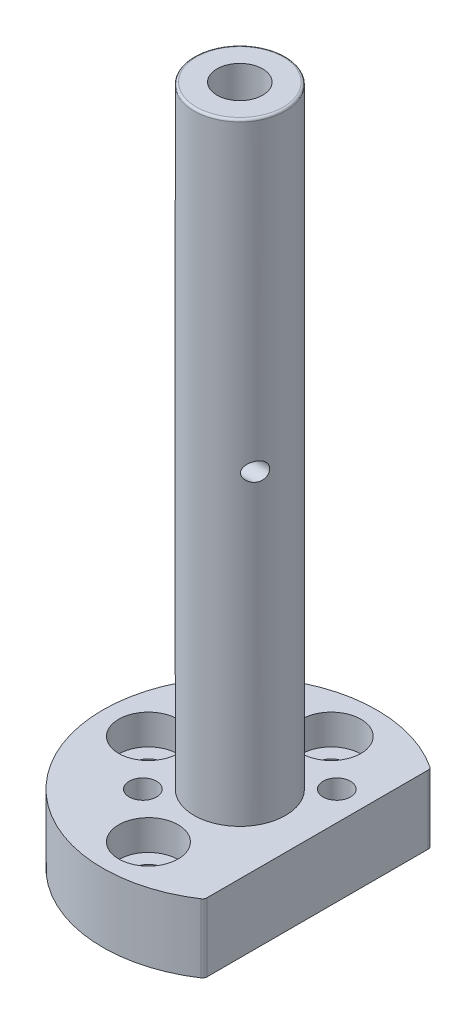
ISO-10303-21;
HEADER;
FILE_DESCRIPTION(('STEP AP214'),'2;1');
FILE_NAME('part.step','',(''),(''),'','','');
FILE_SCHEMA(('AUTOMOTIVE_DESIGN { 1 0 10303 214 1 1 1 1 }'));
ENDSEC;
DATA;
#1=APPLICATION_CONTEXT('core data for automotive mechanical design processes');
#2=APPLICATION_PROTOCOL_DEFINITION('international standard','automotive_design',2000,#1);
#3=PRODUCT_CONTEXT('',#1,'mechanical');
#4=PRODUCT('Part','Part','',(#3));
#5=PRODUCT_RELATED_PRODUCT_CATEGORY('part','',(#4));
#6=PRODUCT_DEFINITION_FORMATION('','',#4);
#7=PRODUCT_DEFINITION_CONTEXT('part definition',#1,'design');
#8=PRODUCT_DEFINITION('design','',#6,#7);
#9=PRODUCT_DEFINITION_SHAPE('','',#8);
#10=(LENGTH_UNIT() NAMED_UNIT(*) SI_UNIT(.MILLI.,.METRE.));
#11=(NAMED_UNIT(*) PLANE_ANGLE_UNIT() SI_UNIT($,.RADIAN.));
#12=(NAMED_UNIT(*) SI_UNIT($,.STERADIAN.) SOLID_ANGLE_UNIT());
#13=UNCERTAINTY_MEASURE_WITH_UNIT(LENGTH_MEASURE(1.E-05),#10,'distance_accuracy_value','');
#14=(GEOMETRIC_REPRESENTATION_CONTEXT(3) GLOBAL_UNCERTAINTY_ASSIGNED_CONTEXT((#13)) GLOBAL_UNIT_ASSIGNED_CONTEXT((#10,
#11,#12)) REPRESENTATION_CONTEXT('',''));
#15=CARTESIAN_POINT('',(0.,0.,0.));
#16=DIRECTION('',(0.,0.,1.));
#17=DIRECTION('',(1.,0.,0.));
#18=AXIS2_PLACEMENT_3D('',#15,#16,#17);
#19=CARTESIAN_POINT('',(0.,15.,0.));
#20=DIRECTION('',(0.,-1.,0.));
#21=DIRECTION('',(0.,0.,-1.));
#22=AXIS2_PLACEMENT_3D('',#19,#20,#21);
#23=CYLINDRICAL_SURFACE('',#22,30.);
#24=CARTESIAN_POINT('',(0.,15.,0.));
#25=DIRECTION('',(0.,1.,0.));
#26=DIRECTION('',(0.,0.,1.));
#27=AXIS2_PLACEMENT_3D('',#24,#25,#26);
#28=CIRCLE('',#27,30.);
#29=CARTESIAN_POINT('',(16.551724137931,15.,-25.0207999085127));
#30=VERTEX_POINT('',#29);
#31=CARTESIAN_POINT('',(16.551724137931,15.,25.0207999085127));
#32=VERTEX_POINT('',#31);
#33=EDGE_CURVE('E107',#30,#32,#28,.T.);
#34=ORIENTED_EDGE('',*,*,#33,.F.);
#35=DIRECTION('',(0.,-1.,0.));
#36=VECTOR('',#35,1.);
#37=CARTESIAN_POINT('',(16.551724137931,15.,-25.0207999085127));
#38=LINE('',#37,#36);
#39=CARTESIAN_POINT('',(16.551724137931,0.,-25.0207999085127));
#40=VERTEX_POINT('',#39);
#41=EDGE_CURVE('E94',#30,#40,#38,.T.);
#42=ORIENTED_EDGE('',*,*,#41,.T.);
#43=CARTESIAN_POINT('',(0.,0.,0.));
#44=DIRECTION('',(0.,1.,0.));
#45=DIRECTION('',(0.,0.,1.));
#46=AXIS2_PLACEMENT_3D('',#43,#44,#45);
#47=CIRCLE('',#46,30.);
#48=CARTESIAN_POINT('',(16.551724137931,0.,25.0207999085127));
#49=VERTEX_POINT('',#48);
#50=EDGE_CURVE('E105',#40,#49,#47,.T.);
#51=ORIENTED_EDGE('',*,*,#50,.T.);
#52=DIRECTION('',(0.,-1.,0.));
#53=VECTOR('',#52,1.);
#54=CARTESIAN_POINT('',(16.551724137931,15.,25.0207999085127));
#55=LINE('',#54,#53);
#56=EDGE_CURVE('E109',#49,#32,#55,.F.);
#57=ORIENTED_EDGE('',*,*,#56,.T.);
#58=EDGE_LOOP('',(#34,#42,#51,#57));
#59=FACE_BOUND('',#58,.T.);
#60=ADVANCED_FACE('F41',(#59),#23,.T.);
#61=CARTESIAN_POINT('',(17.,15.,24.7184141886165));
#62=DIRECTION('',(-1.,0.,0.));
#63=DIRECTION('',(0.,0.,1.));
#64=AXIS2_PLACEMENT_3D('',#61,#62,#63);
#65=PLANE('',#64);
#66=DIRECTION('',(0.,0.,-1.));
#67=VECTOR('',#66,1.);
#68=CARTESIAN_POINT('',(17.,0.,24.7184141886165));
#69=LINE('',#68,#67);
#70=CARTESIAN_POINT('',(17.,0.,24.1867732448956));
#71=VERTEX_POINT('',#70);
#72=CARTESIAN_POINT('',(17.,0.,-24.1867732448956));
#73=VERTEX_POINT('',#72);
#74=EDGE_CURVE('E113',#71,#73,#69,.T.);
#75=ORIENTED_EDGE('',*,*,#74,.T.);
#76=DIRECTION('',(0.,-1.,0.));
#77=VECTOR('',#76,1.);
#78=CARTESIAN_POINT('',(17.,15.,-24.1867732448956));
#79=LINE('',#78,#77);
#80=CARTESIAN_POINT('',(17.,15.,-24.1867732448956));
#81=VERTEX_POINT('',#80);
#82=EDGE_CURVE('E63',#73,#81,#79,.F.);
#83=ORIENTED_EDGE('',*,*,#82,.T.);
#84=DIRECTION('',(0.,0.,-1.));
#85=VECTOR('',#84,1.);
#86=CARTESIAN_POINT('',(17.,15.,24.7184141886165));
#87=LINE('',#86,#85);
#88=CARTESIAN_POINT('',(17.,15.,24.1867732448956));
#89=VERTEX_POINT('',#88);
#90=EDGE_CURVE('E123',#89,#81,#87,.T.);
#91=ORIENTED_EDGE('',*,*,#90,.F.);
#92=DIRECTION('',(0.,-1.,0.));
#93=VECTOR('',#92,1.);
#94=CARTESIAN_POINT('',(17.,15.,24.1867732448956));
#95=LINE('',#94,#93);
#96=EDGE_CURVE('E99',#89,#71,#95,.T.);
#97=ORIENTED_EDGE('',*,*,#96,.T.);
#98=EDGE_LOOP('',(#75,#83,#91,#97));
#99=FACE_BOUND('',#98,.T.);
#100=ADVANCED_FACE('F160',(#99),#65,.F.);
#101=CARTESIAN_POINT('',(0.,15.,0.));
#102=DIRECTION('',(0.,1.,0.));
#103=DIRECTION('',(0.,0.,1.));
#104=AXIS2_PLACEMENT_3D('',#101,#102,#103);
#105=PLANE('',#104);
#106=CARTESIAN_POINT('',(-10.6066017177983,15.,10.6066017177982));
#107=DIRECTION('',(0.,1.,0.));
#108=DIRECTION('',(0.,0.,1.));
#109=AXIS2_PLACEMENT_3D('',#106,#107,#108);
#110=CIRCLE('',#109,3.);
#111=CARTESIAN_POINT('',(-10.6066017177983,15.,13.6066017177982));
#112=VERTEX_POINT('',#111);
#113=EDGE_CURVE('E261',#112,#112,#110,.T.);
#114=ORIENTED_EDGE('',*,*,#113,.F.);
#115=EDGE_LOOP('',(#114));
#116=FACE_BOUND('',#115,.T.);
#117=CARTESIAN_POINT('',(10.6066017177982,15.,-10.6066017177982));
#118=DIRECTION('',(0.,1.,0.));
#119=DIRECTION('',(0.,0.,1.));
#120=AXIS2_PLACEMENT_3D('',#117,#118,#119);
#121=CIRCLE('',#120,3.);
#122=CARTESIAN_POINT('',(10.6066017177982,15.,-7.60660171779821));
#123=VERTEX_POINT('',#122);
#124=EDGE_CURVE('E255',#123,#123,#121,.T.);
#125=ORIENTED_EDGE('',*,*,#124,.F.);
#126=EDGE_LOOP('',(#125));
#127=FACE_BOUND('',#126,.T.);
#128=CARTESIAN_POINT('',(0.,15.,20.));
#129=DIRECTION('',(0.,1.,0.));
#130=DIRECTION('',(0.,0.,1.));
#131=AXIS2_PLACEMENT_3D('',#128,#129,#130);
#132=CIRCLE('',#131,6.5);
#133=CARTESIAN_POINT('',(0.,15.,26.5));
#134=VERTEX_POINT('',#133);
#135=EDGE_CURVE('E301',#134,#134,#132,.T.);
#136=ORIENTED_EDGE('',*,*,#135,.F.);
#137=EDGE_LOOP('',(#136));
#138=FACE_BOUND('',#137,.T.);
#139=CARTESIAN_POINT('',(-20.,15.,0.));
#140=DIRECTION('',(0.,1.,0.));
#141=DIRECTION('',(0.,0.,1.));
#142=AXIS2_PLACEMENT_3D('',#139,#140,#141);
#143=CIRCLE('',#142,6.5);
#144=CARTESIAN_POINT('',(-20.,15.,6.5));
#145=VERTEX_POINT('',#144);
#146=EDGE_CURVE('E309',#145,#145,#143,.T.);
#147=ORIENTED_EDGE('',*,*,#146,.F.);
#148=EDGE_LOOP('',(#147));
#149=FACE_BOUND('',#148,.T.);
#150=CARTESIAN_POINT('',(0.,15.,-20.));
#151=DIRECTION('',(0.,1.,0.));
#152=DIRECTION('',(0.,0.,-1.));
#153=AXIS2_PLACEMENT_3D('',#150,#151,#152);
#154=CIRCLE('',#153,6.5);
#155=CARTESIAN_POINT('',(0.,15.,-26.5));
#156=VERTEX_POINT('',#155);
#157=EDGE_CURVE('E276',#156,#156,#154,.T.);
#158=ORIENTED_EDGE('',*,*,#157,.F.);
#159=EDGE_LOOP('',(#158));
#160=FACE_BOUND('',#159,.T.);
#161=CARTESIAN_POINT('',(0.,15.,0.));
#162=DIRECTION('',(0.,1.,0.));
#163=DIRECTION('',(0.,0.,1.));
#164=AXIS2_PLACEMENT_3D('',#161,#162,#163);
#165=CIRCLE('',#164,10.);
#166=CARTESIAN_POINT('',(0.,15.,10.));
#167=VERTEX_POINT('',#166);
#168=EDGE_CURVE('E127',#167,#167,#165,.T.);
#169=ORIENTED_EDGE('',*,*,#168,.F.);
#170=EDGE_LOOP('',(#169));
#171=FACE_BOUND('',#170,.T.);
#172=ORIENTED_EDGE('',*,*,#90,.T.);
#173=CARTESIAN_POINT('',(16.,15.,-24.1867732448956));
#174=DIRECTION('',(0.,1.,0.));
#175=DIRECTION('',(0.,0.,1.));
#176=AXIS2_PLACEMENT_3D('',#173,#174,#175);
#177=CIRCLE('',#176,1.);
#178=EDGE_CURVE('E138',#81,#30,#177,.T.);
#179=ORIENTED_EDGE('',*,*,#178,.T.);
#180=ORIENTED_EDGE('',*,*,#33,.T.);
#181=CARTESIAN_POINT('',(16.,15.,24.1867732448956));
#182=DIRECTION('',(0.,1.,0.));
#183=DIRECTION('',(0.,0.,1.));
#184=AXIS2_PLACEMENT_3D('',#181,#182,#183);
#185=CIRCLE('',#184,1.);
#186=EDGE_CURVE('E70',#32,#89,#185,.T.);
#187=ORIENTED_EDGE('',*,*,#186,.T.);
#188=EDGE_LOOP('',(#172,#179,#180,#187));
#189=FACE_BOUND('',#188,.T.);
#190=ADVANCED_FACE('F165',(#116,#127,#138,#149,#160,#171,#189),#105,.T.);
#191=CARTESIAN_POINT('',(0.,0.,0.));
#192=DIRECTION('',(0.,1.,0.));
#193=DIRECTION('',(0.,0.,1.));
#194=AXIS2_PLACEMENT_3D('',#191,#192,#193);
#195=PLANE('',#194);
#196=CARTESIAN_POINT('',(-10.6066017177983,0.,10.6066017177982));
#197=DIRECTION('',(0.,1.,0.));
#198=DIRECTION('',(0.,0.,1.));
#199=AXIS2_PLACEMENT_3D('',#196,#197,#198);
#200=CIRCLE('',#199,3.);
#201=CARTESIAN_POINT('',(-10.6066017177983,0.,13.6066017177982));
#202=VERTEX_POINT('',#201);
#203=EDGE_CURVE('E256',#202,#202,#200,.T.);
#204=ORIENTED_EDGE('',*,*,#203,.T.);
#205=EDGE_LOOP('',(#204));
#206=FACE_BOUND('',#205,.T.);
#207=CARTESIAN_POINT('',(10.6066017177982,0.,-10.6066017177982));
#208=DIRECTION('',(0.,1.,0.));
#209=DIRECTION('',(0.,0.,1.));
#210=AXIS2_PLACEMENT_3D('',#207,#208,#209);
#211=CIRCLE('',#210,3.);
#212=CARTESIAN_POINT('',(10.6066017177982,0.,-7.60660171779821));
#213=VERTEX_POINT('',#212);
#214=EDGE_CURVE('E265',#213,#213,#211,.T.);
#215=ORIENTED_EDGE('',*,*,#214,.T.);
#216=EDGE_LOOP('',(#215));
#217=FACE_BOUND('',#216,.T.);
#218=CARTESIAN_POINT('',(0.,0.,20.));
#219=DIRECTION('',(0.,1.,0.));
#220=DIRECTION('',(0.,0.,1.));
#221=AXIS2_PLACEMENT_3D('',#218,#219,#220);
#222=CIRCLE('',#221,3.3);
#223=CARTESIAN_POINT('',(0.,0.,23.3));
#224=VERTEX_POINT('',#223);
#225=EDGE_CURVE('E272',#224,#224,#222,.T.);
#226=ORIENTED_EDGE('',*,*,#225,.T.);
#227=EDGE_LOOP('',(#226));
#228=FACE_BOUND('',#227,.T.);
#229=CARTESIAN_POINT('',(-20.,0.,0.));
#230=DIRECTION('',(0.,1.,0.));
#231=DIRECTION('',(0.,0.,1.));
#232=AXIS2_PLACEMENT_3D('',#229,#230,#231);
#233=CIRCLE('',#232,3.3);
#234=CARTESIAN_POINT('',(-20.,0.,3.3));
#235=VERTEX_POINT('',#234);
#236=EDGE_CURVE('E281',#235,#235,#233,.T.);
#237=ORIENTED_EDGE('',*,*,#236,.T.);
#238=EDGE_LOOP('',(#237));
#239=FACE_BOUND('',#238,.T.);
#240=CARTESIAN_POINT('',(0.,0.,-20.));
#241=DIRECTION('',(0.,1.,0.));
#242=DIRECTION('',(0.,0.,-1.));
#243=AXIS2_PLACEMENT_3D('',#240,#241,#242);
#244=CIRCLE('',#243,3.3);
#245=CARTESIAN_POINT('',(0.,0.,-23.3));
#246=VERTEX_POINT('',#245);
#247=EDGE_CURVE('E289',#246,#246,#244,.T.);
#248=ORIENTED_EDGE('',*,*,#247,.T.);
#249=EDGE_LOOP('',(#248));
#250=FACE_BOUND('',#249,.T.);
#251=CARTESIAN_POINT('',(0.,0.,0.));
#252=DIRECTION('',(0.,-1.,0.));
#253=DIRECTION('',(0.,0.,-1.));
#254=AXIS2_PLACEMENT_3D('',#251,#252,#253);
#255=CIRCLE('',#254,7.25);
#256=CARTESIAN_POINT('',(0.,0.,-7.25));
#257=VERTEX_POINT('',#256);
#258=EDGE_CURVE('E120',#257,#257,#255,.T.);
#259=ORIENTED_EDGE('',*,*,#258,.F.);
#260=EDGE_LOOP('',(#259));
#261=FACE_BOUND('',#260,.T.);
#262=ORIENTED_EDGE('',*,*,#50,.F.);
#263=CARTESIAN_POINT('',(16.,0.,-24.1867732448956));
#264=DIRECTION('',(0.,1.,0.));
#265=DIRECTION('',(0.,0.,1.));
#266=AXIS2_PLACEMENT_3D('',#263,#264,#265);
#267=CIRCLE('',#266,1.);
#268=EDGE_CURVE('E90',#40,#73,#267,.F.);
#269=ORIENTED_EDGE('',*,*,#268,.T.);
#270=ORIENTED_EDGE('',*,*,#74,.F.);
#271=CARTESIAN_POINT('',(16.,0.,24.1867732448956));
#272=DIRECTION('',(0.,1.,0.));
#273=DIRECTION('',(0.,0.,1.));
#274=AXIS2_PLACEMENT_3D('',#271,#272,#273);
#275=CIRCLE('',#274,1.);
#276=EDGE_CURVE('E100',#71,#49,#275,.F.);
#277=ORIENTED_EDGE('',*,*,#276,.T.);
#278=EDGE_LOOP('',(#262,#269,#270,#277));
#279=FACE_BOUND('',#278,.T.);
#280=ADVANCED_FACE('F111',(#206,#217,#228,#239,#250,#261,#279),#195,.F.);
#281=CARTESIAN_POINT('',(0.,149.,0.));
#282=DIRECTION('',(0.,-1.,0.));
#283=DIRECTION('',(0.,0.,-1.));
#284=AXIS2_PLACEMENT_3D('',#281,#282,#283);
#285=CYLINDRICAL_SURFACE('',#284,10.);
#286=CARTESIAN_POINT('',(-9.53939201416946,82.,3.));
#287=CARTESIAN_POINT('',(-9.53939211755733,82.1078432268021,3.00000144407373));
#288=CARTESIAN_POINT('',(-9.53665322959864,82.2157032674124,3.00875128127138));
#289=CARTESIAN_POINT('',(-9.52563893501992,82.428350400446,3.04343984855813));
#290=CARTESIAN_POINT('',(-9.51736203957329,82.5331366586103,3.06938320089882));
#291=CARTESIAN_POINT('',(-9.49512562017939,82.7365925855606,3.13749306643533));
#292=CARTESIAN_POINT('',(-9.48116908824297,82.8352654433753,3.17965103719117));
#293=CARTESIAN_POINT('',(-9.44739494293747,83.0238378502898,3.27863540249102));
#294=CARTESIAN_POINT('',(-9.42757774203097,83.1137380162027,3.3354607647365));
#295=CARTESIAN_POINT('',(-9.38173759418536,83.2832839853038,3.46230774348198));
#296=CARTESIAN_POINT('',(-9.35565726872737,83.362823822435,3.53245003745135));
#297=CARTESIAN_POINT('',(-9.29741042636078,83.5088333930081,3.68302399953707));
#298=CARTESIAN_POINT('',(-9.26524326996758,83.5753017516583,3.7634567484844));
#299=CARTESIAN_POINT('',(-9.19368137773744,83.6963148509398,3.93512182052744));
#300=CARTESIAN_POINT('',(-9.1540555211466,83.7503000747468,4.02665122748365));
#301=CARTESIAN_POINT('',(-9.0689621965015,83.8424049007675,4.2148064876194));
#302=CARTESIAN_POINT('',(-9.02349296578571,83.8805197008767,4.31143387340528));
#303=CARTESIAN_POINT('',(-8.92359915366346,83.9433892177307,4.5147746326115));
#304=CARTESIAN_POINT('',(-8.86875021396026,83.9668433257545,4.62167978724249));
#305=CARTESIAN_POINT('',(-8.75415075230912,83.9961183953185,4.83524156989439));
#306=CARTESIAN_POINT('',(-8.69439832773051,84.0019324787034,4.94189808477365));
#307=CARTESIAN_POINT('',(-8.56379200801821,83.9966513215073,5.16528133712512));
#308=CARTESIAN_POINT('',(-8.49246623834658,83.9834439913296,5.28168128528971));
#309=CARTESIAN_POINT('',(-8.34694478508566,83.9376729002848,5.50878841962288));
#310=CARTESIAN_POINT('',(-8.27274674206313,83.9050928961331,5.61949074380998));
#311=CARTESIAN_POINT('',(-8.1142023095457,83.8166238774676,5.84646565698449));
#312=CARTESIAN_POINT('',(-8.02973740328472,83.7583473268338,5.96172942872328));
#313=CARTESIAN_POINT('',(-7.86290917493328,83.6199079222975,6.18009023484846));
#314=CARTESIAN_POINT('',(-7.78054571530673,83.5397465047606,6.28318806708408));
#315=CARTESIAN_POINT('',(-7.63784801137646,83.3757908954203,6.45548188273154));
#316=CARTESIAN_POINT('',(-7.57636633928086,83.2958094057625,6.52735805210799));
#317=CARTESIAN_POINT('',(-7.4607147550622,83.1219654955586,6.65923333050076));
#318=CARTESIAN_POINT('',(-7.40653245255699,83.0281271789405,6.71925264894009));
#319=CARTESIAN_POINT('',(-7.32117048146995,82.8509466191529,6.81200884570583));
#320=CARTESIAN_POINT('',(-7.28758318662971,82.7703955958487,6.84784015997291));
#321=CARTESIAN_POINT('',(-7.22941531381252,82.6023699530978,6.90922182791959));
#322=CARTESIAN_POINT('',(-7.20482710682637,82.5149012749862,6.93478089174884));
#323=CARTESIAN_POINT('',(-7.16679040078739,82.3340692264959,6.97408716641552));
#324=CARTESIAN_POINT('',(-7.15344300230179,82.2406603181776,6.98772721712533));
#325=CARTESIAN_POINT('',(-7.13990883739731,82.051924183694,7.00155772395048));
#326=CARTESIAN_POINT('',(-7.13971170878817,81.9565985271493,7.00175876977463));
#327=CARTESIAN_POINT('',(-7.15159060586103,81.7806272712357,6.98962024574339));
#328=CARTESIAN_POINT('',(-7.16201038796452,81.6997398587397,6.97897301990207));
#329=CARTESIAN_POINT('',(-7.19168428265346,81.5414338851677,6.94839030936794));
#330=CARTESIAN_POINT('',(-7.21094269418245,81.4640170322428,6.92845030476888));
#331=CARTESIAN_POINT('',(-7.26342595110988,81.2926066245738,6.87346027470903));
#332=CARTESIAN_POINT('',(-7.2990719632592,81.2002236847039,6.83571724822473));
#333=CARTESIAN_POINT('',(-7.37929613481388,81.0250799597254,6.7490356016179));
#334=CARTESIAN_POINT('',(-7.42389164859867,80.9423383711205,6.70007520284169));
#335=CARTESIAN_POINT('',(-7.53449309723022,80.7620217958571,6.57573864722096));
#336=CARTESIAN_POINT('',(-7.60277513899433,80.6682188635214,6.49692898400146));
#337=CARTESIAN_POINT('',(-7.74513498725234,80.4984161211933,6.32655162106975));
#338=CARTESIAN_POINT('',(-7.81921766073449,80.4224314797556,6.23497315636633));
#339=CARTESIAN_POINT('',(-7.97117592311259,80.2871839311294,6.03953193169637));
#340=CARTESIAN_POINT('',(-8.0490961132577,80.2282524861741,5.93547503417447));
#341=CARTESIAN_POINT('',(-8.20470890907491,80.1296941426002,5.71844371896428));
#342=CARTESIAN_POINT('',(-8.28240149952038,80.0900685075087,5.60546871816591));
#343=CARTESIAN_POINT('',(-8.44457280771942,80.0277963102748,5.35849965905416));
#344=CARTESIAN_POINT('',(-8.52873534272202,80.0077839479534,5.22361626022439));
#345=CARTESIAN_POINT('',(-8.69100343674394,79.9959390957662,4.94892503395674));
#346=CARTESIAN_POINT('',(-8.76911000017641,80.0041019226383,4.80911802874116));
#347=CARTESIAN_POINT('',(-8.91107233970391,80.0491485268292,4.54028234820867));
#348=CARTESIAN_POINT('',(-8.97555631505382,80.0838469832999,4.4112267533464));
#349=CARTESIAN_POINT('',(-9.09514533687018,80.1803923207165,4.15905573470748));
#350=CARTESIAN_POINT('',(-9.15026188921165,80.242205557662,4.03593315870205));
#351=CARTESIAN_POINT('',(-9.24289613435602,80.3818671260398,3.81849407697402));
#352=CARTESIAN_POINT('',(-9.2817960427082,80.4562792978824,3.72255451590157));
#353=CARTESIAN_POINT('',(-9.35131879121076,80.6231279461733,3.54429016603627));
#354=CARTESIAN_POINT('',(-9.38194645072669,80.7155538736349,3.46195746086497));
#355=CARTESIAN_POINT('',(-9.43222224437536,80.9054531004781,3.3223709115449));
#356=CARTESIAN_POINT('',(-9.45266597583031,81.0014782333728,3.26342556919702));
#357=CARTESIAN_POINT('',(-9.4870063426905,81.2029911803698,3.16221155915056));
#358=CARTESIAN_POINT('',(-9.50090705751141,81.3084730494481,3.11993250309759));
#359=CARTESIAN_POINT('',(-9.52094536206614,81.5110818660883,3.05818640046483));
#360=CARTESIAN_POINT('',(-9.52787245792646,81.6074400053052,3.03642498155418));
#361=CARTESIAN_POINT('',(-9.53709556983314,81.8025275119141,3.00733163996599));
#362=CARTESIAN_POINT('',(-9.53939191950557,81.9012567079626,2.99999867777886));
#363=CARTESIAN_POINT('',(-9.53939201416946,82.,3.));
#364=B_SPLINE_CURVE_WITH_KNOTS('',3,(#286,#287,#288,#289,#290,#291,#292,#293,#294,#295,#296,
#297,#298,#299,#300,#301,#302,#303,#304,#305,#306,#307,#308,#309,#310,#311,#312,#313,#314,#315,
#316,#317,#318,#319,#320,#321,#322,#323,#324,#325,#326,#327,#328,#329,#330,#331,#332,#333,#334,
#335,#336,#337,#338,#339,#340,#341,#342,#343,#344,#345,#346,#347,#348,#349,#350,#351,#352,#353,
#354,#355,#356,#357,#358,#359,#360,#361,#362,#363),.UNSPECIFIED.,.T.,.F.,(4,2,2,2,2,2,2,2,2,2,2,
2,2,2,2,2,2,2,2,2,2,2,2,2,2,2,2,2,2,2,2,2,2,2,2,2,2,2,4),(0.,0.323173196200586,
0.646433308549124,0.969523348691965,1.29259065578976,1.61873887729069,1.94492138308186,
2.28369893168693,2.62257891391914,2.98835773871399,3.35427916877873,3.76409613575129,
4.17425720487948,4.63522894510468,5.09617043772094,5.46648906419166,5.83617094903617,
6.11815142133564,6.39989228690106,6.68414087820215,6.96816548377287,7.21377795910425,
7.45951002254533,7.77569108966934,8.0924913074135,8.51104889941355,8.92996152269598,
9.35654041882128,9.78314722994196,10.2613666098942,10.7395065043525,11.1820201164254,
11.6239862042202,12.004346333141,12.3844843860509,12.7262999512446,13.0679021193264,
13.3638269126943,13.6597303851456),.UNSPECIFIED.);
#365=CARTESIAN_POINT('',(-9.53939201416946,82.,3.));
#366=VERTEX_POINT('',#365);
#367=EDGE_CURVE('E248',#366,#366,#364,.T.);
#368=ORIENTED_EDGE('',*,*,#367,.T.);
#369=EDGE_LOOP('',(#368));
#370=FACE_BOUND('',#369,.T.);
#371=CARTESIAN_POINT('',(9.53939201416946,82.,3.));
#372=CARTESIAN_POINT('',(9.53939211755733,81.8921567731979,3.00000144407373));
#373=CARTESIAN_POINT('',(9.53665322959864,81.7842967325876,3.00875128127138));
#374=CARTESIAN_POINT('',(9.52563893501992,81.571649599554,3.04343984855813));
#375=CARTESIAN_POINT('',(9.51736203957329,81.4668633413897,3.06938320089882));
#376=CARTESIAN_POINT('',(9.49512562017939,81.2634074144394,3.13749306643532));
#377=CARTESIAN_POINT('',(9.48116908824297,81.1647345566247,3.17965103719117));
#378=CARTESIAN_POINT('',(9.44739494293747,80.9761621497102,3.27863540249102));
#379=CARTESIAN_POINT('',(9.42757774203097,80.8862619837973,3.33546076473651));
#380=CARTESIAN_POINT('',(9.38173759418537,80.7167160146962,3.46230774348197));
#381=CARTESIAN_POINT('',(9.35565726872737,80.6371761775651,3.53245003745134));
#382=CARTESIAN_POINT('',(9.29741042636078,80.4911666069919,3.68302399953706));
#383=CARTESIAN_POINT('',(9.26524326996759,80.4246982483418,3.76345674848439));
#384=CARTESIAN_POINT('',(9.19368137773744,80.3036851490602,3.93512182052744));
#385=CARTESIAN_POINT('',(9.1540555211466,80.2496999252532,4.02665122748365));
#386=CARTESIAN_POINT('',(9.0689621965015,80.1575950992326,4.2148064876194));
#387=CARTESIAN_POINT('',(9.02349296578571,80.1194802991233,4.31143387340528));
#388=CARTESIAN_POINT('',(8.92359915366346,80.0566107822693,4.5147746326115));
#389=CARTESIAN_POINT('',(8.86875021396026,80.0331566742455,4.62167978724249));
#390=CARTESIAN_POINT('',(8.75415075230912,80.0038816046815,4.83524156989439));
#391=CARTESIAN_POINT('',(8.69439832773051,79.9980675212966,4.94189808477365));
#392=CARTESIAN_POINT('',(8.56379200801821,80.0033486784927,5.16528133712512));
#393=CARTESIAN_POINT('',(8.49246623834658,80.0165560086704,5.28168128528971));
#394=CARTESIAN_POINT('',(8.34694478508566,80.0623270997152,5.50878841962288));
#395=CARTESIAN_POINT('',(8.27274674206313,80.0949071038669,5.61949074380998));
#396=CARTESIAN_POINT('',(8.1142023095457,80.1833761225324,5.84646565698449));
#397=CARTESIAN_POINT('',(8.02973740328471,80.2416526731662,5.96172942872328));
#398=CARTESIAN_POINT('',(7.86290917493328,80.3800920777025,6.18009023484847));
#399=CARTESIAN_POINT('',(7.78054571530672,80.4602534952394,6.28318806708408));
#400=CARTESIAN_POINT('',(7.63784801137646,80.6242091045797,6.45548188273154));
#401=CARTESIAN_POINT('',(7.57636633928086,80.7041905942375,6.52735805210799));
#402=CARTESIAN_POINT('',(7.4607147550622,80.8780345044414,6.65923333050076));
#403=CARTESIAN_POINT('',(7.40653245255699,80.9718728210595,6.71925264894009));
#404=CARTESIAN_POINT('',(7.32117048146995,81.1490533808471,6.81200884570583));
#405=CARTESIAN_POINT('',(7.28758318662971,81.2296044041513,6.84784015997291));
#406=CARTESIAN_POINT('',(7.22941531381253,81.3976300469022,6.90922182791959));
#407=CARTESIAN_POINT('',(7.20482710682637,81.4850987250138,6.93478089174884));
#408=CARTESIAN_POINT('',(7.16679040078739,81.6659307735041,6.97408716641552));
#409=CARTESIAN_POINT('',(7.15344300230179,81.7593396818224,6.98772721712533));
#410=CARTESIAN_POINT('',(7.13990883739731,81.948075816306,7.00155772395048));
#411=CARTESIAN_POINT('',(7.13971170878817,82.0434014728507,7.00175876977463));
#412=CARTESIAN_POINT('',(7.15159060586103,82.2193727287643,6.98962024574339));
#413=CARTESIAN_POINT('',(7.16201038796452,82.3002601412603,6.97897301990207));
#414=CARTESIAN_POINT('',(7.19168428265346,82.4585661148323,6.94839030936794));
#415=CARTESIAN_POINT('',(7.21094269418245,82.5359829677572,6.92845030476888));
#416=CARTESIAN_POINT('',(7.26342595110988,82.7073933754262,6.87346027470903));
#417=CARTESIAN_POINT('',(7.2990719632592,82.7997763152961,6.83571724822473));
#418=CARTESIAN_POINT('',(7.37929613481388,82.9749200402745,6.7490356016179));
#419=CARTESIAN_POINT('',(7.42389164859867,83.0576616288795,6.70007520284169));
#420=CARTESIAN_POINT('',(7.53449309723022,83.2379782041429,6.57573864722096));
#421=CARTESIAN_POINT('',(7.60277513899433,83.3317811364786,6.49692898400146));
#422=CARTESIAN_POINT('',(7.74513498725234,83.5015838788068,6.32655162106975));
#423=CARTESIAN_POINT('',(7.81921766073449,83.5775685202444,6.23497315636633));
#424=CARTESIAN_POINT('',(7.97117592311259,83.7128160688706,6.03953193169637));
#425=CARTESIAN_POINT('',(8.0490961132577,83.7717475138259,5.93547503417447));
#426=CARTESIAN_POINT('',(8.20470890907491,83.8703058573998,5.71844371896428));
#427=CARTESIAN_POINT('',(8.28240149952038,83.9099314924913,5.60546871816591));
#428=CARTESIAN_POINT('',(8.44457280771942,83.9722036897252,5.35849965905416));
#429=CARTESIAN_POINT('',(8.52873534272202,83.9922160520467,5.22361626022439));
#430=CARTESIAN_POINT('',(8.69100343674394,84.0040609042339,4.94892503395674));
#431=CARTESIAN_POINT('',(8.76911000017641,83.9958980773617,4.80911802874116));
#432=CARTESIAN_POINT('',(8.91107233970391,83.9508514731708,4.54028234820867));
#433=CARTESIAN_POINT('',(8.97555631505382,83.9161530167001,4.4112267533464));
#434=CARTESIAN_POINT('',(9.09514533687018,83.8196076792835,4.15905573470748));
#435=CARTESIAN_POINT('',(9.15026188921165,83.757794442338,4.03593315870205));
#436=CARTESIAN_POINT('',(9.24289613435602,83.6181328739602,3.81849407697402));
#437=CARTESIAN_POINT('',(9.2817960427082,83.5437207021176,3.72255451590157));
#438=CARTESIAN_POINT('',(9.35131879121076,83.3768720538267,3.54429016603627));
#439=CARTESIAN_POINT('',(9.38194645072669,83.2844461263652,3.46195746086497));
#440=CARTESIAN_POINT('',(9.43222224437536,83.0945468995219,3.3223709115449));
#441=CARTESIAN_POINT('',(9.45266597583031,82.9985217666272,3.26342556919702));
#442=CARTESIAN_POINT('',(9.4870063426905,82.7970088196302,3.16221155915056));
#443=CARTESIAN_POINT('',(9.50090705751141,82.6915269505519,3.11993250309759));
#444=CARTESIAN_POINT('',(9.52094536206614,82.4889181339118,3.05818640046483));
#445=CARTESIAN_POINT('',(9.52787245792646,82.3925599946948,3.03642498155418));
#446=CARTESIAN_POINT('',(9.53709556983314,82.1974724880859,3.00733163996599));
#447=CARTESIAN_POINT('',(9.53939191950557,82.0987432920374,2.99999867777886));
#448=CARTESIAN_POINT('',(9.53939201416946,82.,3.));
#449=B_SPLINE_CURVE_WITH_KNOTS('',3,(#371,#372,#373,#374,#375,#376,#377,#378,#379,#380,#381,
#382,#383,#384,#385,#386,#387,#388,#389,#390,#391,#392,#393,#394,#395,#396,#397,#398,#399,#400,
#401,#402,#403,#404,#405,#406,#407,#408,#409,#410,#411,#412,#413,#414,#415,#416,#417,#418,#419,
#420,#421,#422,#423,#424,#425,#426,#427,#428,#429,#430,#431,#432,#433,#434,#435,#436,#437,#438,
#439,#440,#441,#442,#443,#444,#445,#446,#447,#448),.UNSPECIFIED.,.T.,.F.,(4,2,2,2,2,2,2,2,2,2,2,
2,2,2,2,2,2,2,2,2,2,2,2,2,2,2,2,2,2,2,2,2,2,2,2,2,2,2,4),(0.,0.323173196200586,
0.646433308549124,0.969523348691965,1.29259065578976,1.61873887729067,1.94492138308186,
2.28369893168693,2.62257891391914,2.98835773871399,3.35427916877873,3.76409613575129,
4.17425720487948,4.63522894510468,5.09617043772094,5.46648906419166,5.83617094903617,
6.11815142133563,6.39989228690106,6.68414087820216,6.96816548377287,7.21377795910426,
7.45951002254533,7.77569108966932,8.0924913074135,8.51104889941355,8.92996152269598,
9.35654041882128,9.78314722994196,10.2613666098942,10.7395065043525,11.1820201164254,
11.6239862042203,12.004346333141,12.3844843860509,12.7262999512446,13.0679021193264,
13.3638269126943,13.6597303851456),.UNSPECIFIED.);
#450=CARTESIAN_POINT('',(9.53939201416946,82.,3.));
#451=VERTEX_POINT('',#450);
#452=EDGE_CURVE('E243',#451,#451,#449,.T.);
#453=ORIENTED_EDGE('',*,*,#452,.T.);
#454=EDGE_LOOP('',(#453));
#455=FACE_BOUND('',#454,.T.);
#456=CARTESIAN_POINT('',(0.,148.5,0.));
#457=DIRECTION('',(0.,1.,0.));
#458=DIRECTION('',(0.,0.,1.));
#459=AXIS2_PLACEMENT_3D('',#456,#457,#458);
#460=CIRCLE('',#459,10.);
#461=CARTESIAN_POINT('',(0.,148.5,10.));
#462=VERTEX_POINT('',#461);
#463=EDGE_CURVE('E11',#462,#462,#460,.F.);
#464=ORIENTED_EDGE('',*,*,#463,.T.);
#465=EDGE_LOOP('',(#464));
#466=FACE_BOUND('',#465,.T.);
#467=ORIENTED_EDGE('',*,*,#168,.T.);
#468=EDGE_LOOP('',(#467));
#469=FACE_BOUND('',#468,.T.);
#470=ADVANCED_FACE('F236',(#370,#455,#466,#469),#285,.T.);
#471=CARTESIAN_POINT('',(0.,149.,0.));
#472=DIRECTION('',(0.,1.,0.));
#473=DIRECTION('',(0.,0.,1.));
#474=AXIS2_PLACEMENT_3D('',#471,#472,#473);
#475=PLANE('',#474);
#476=CARTESIAN_POINT('',(0.,149.,0.));
#477=DIRECTION('',(0.,1.,0.));
#478=DIRECTION('',(0.,0.,1.));
#479=AXIS2_PLACEMENT_3D('',#476,#477,#478);
#480=CIRCLE('',#479,9.5);
#481=CARTESIAN_POINT('',(0.,149.,9.5));
#482=VERTEX_POINT('',#481);
#483=EDGE_CURVE('E56',#482,#482,#480,.T.);
#484=ORIENTED_EDGE('',*,*,#483,.T.);
#485=EDGE_LOOP('',(#484));
#486=FACE_BOUND('',#485,.T.);
#487=CARTESIAN_POINT('',(0.,149.,0.));
#488=DIRECTION('',(0.,-1.,0.));
#489=DIRECTION('',(0.,0.,-1.));
#490=AXIS2_PLACEMENT_3D('',#487,#488,#489);
#491=CIRCLE('',#490,5.);
#492=CARTESIAN_POINT('',(0.,149.,-5.));
#493=VERTEX_POINT('',#492);
#494=EDGE_CURVE('E320',#493,#493,#491,.T.);
#495=ORIENTED_EDGE('',*,*,#494,.T.);
#496=EDGE_LOOP('',(#495));
#497=FACE_BOUND('',#496,.T.);
#498=ADVANCED_FACE('F145',(#486,#497),#475,.T.);
#499=CARTESIAN_POINT('',(0.,57.,0.));
#500=DIRECTION('',(0.,-1.,0.));
#501=DIRECTION('',(0.,0.,-1.));
#502=AXIS2_PLACEMENT_3D('',#499,#500,#501);
#503=CYLINDRICAL_SURFACE('',#502,7.25);
#504=CARTESIAN_POINT('',(0.,57.,0.));
#505=DIRECTION('',(0.,-1.,0.));
#506=DIRECTION('',(0.,0.,-1.));
#507=AXIS2_PLACEMENT_3D('',#504,#505,#506);
#508=CIRCLE('',#507,7.25);
#509=CARTESIAN_POINT('',(0.,57.,-7.25));
#510=VERTEX_POINT('',#509);
#511=EDGE_CURVE('E114',#510,#510,#508,.T.);
#512=ORIENTED_EDGE('',*,*,#511,.F.);
#513=EDGE_LOOP('',(#512));
#514=FACE_BOUND('',#513,.T.);
#515=ORIENTED_EDGE('',*,*,#258,.T.);
#516=EDGE_LOOP('',(#515));
#517=FACE_BOUND('',#516,.T.);
#518=ADVANCED_FACE('F229',(#514,#517),#503,.F.);
#519=CARTESIAN_POINT('',(0.,57.,0.));
#520=DIRECTION('',(0.,-1.,0.));
#521=DIRECTION('',(0.,0.,-1.));
#522=AXIS2_PLACEMENT_3D('',#519,#520,#521);
#523=PLANE('',#522);
#524=CARTESIAN_POINT('',(0.,57.,0.));
#525=DIRECTION('',(0.,-1.,0.));
#526=DIRECTION('',(0.,0.,-1.));
#527=AXIS2_PLACEMENT_3D('',#524,#525,#526);
#528=CIRCLE('',#527,5.);
#529=CARTESIAN_POINT('',(0.,57.,-5.));
#530=VERTEX_POINT('',#529);
#531=EDGE_CURVE('E300',#530,#530,#528,.T.);
#532=ORIENTED_EDGE('',*,*,#531,.F.);
#533=EDGE_LOOP('',(#532));
#534=FACE_BOUND('',#533,.T.);
#535=ORIENTED_EDGE('',*,*,#511,.T.);
#536=EDGE_LOOP('',(#535));
#537=FACE_BOUND('',#536,.T.);
#538=ADVANCED_FACE('F225',(#534,#537),#523,.T.);
#539=CARTESIAN_POINT('',(0.,149.,0.));
#540=DIRECTION('',(0.,-1.,0.));
#541=DIRECTION('',(0.,0.,-1.));
#542=AXIS2_PLACEMENT_3D('',#539,#540,#541);
#543=CYLINDRICAL_SURFACE('',#542,5.);
#544=CARTESIAN_POINT('',(-4.,82.,3.));
#545=CARTESIAN_POINT('',(-4.00000000072551,81.9072627867282,3.00000135596089));
#546=CARTESIAN_POINT('',(-3.99516043631315,81.8145107061337,3.00648582296121));
#547=CARTESIAN_POINT('',(-3.97581205691488,81.6317805560535,3.03202372065634));
#548=CARTESIAN_POINT('',(-3.96130070246548,81.5418032216095,3.05108045236138));
#549=CARTESIAN_POINT('',(-3.92271386202954,81.3673714343172,3.10053026227591));
#550=CARTESIAN_POINT('',(-3.89865512693191,81.282907608656,3.13090348002475));
#551=CARTESIAN_POINT('',(-3.84120112748192,81.1214707560312,3.20112819977807));
#552=CARTESIAN_POINT('',(-3.8078060543256,81.0444975757123,3.24097950768111));
#553=CARTESIAN_POINT('',(-3.73112610908567,80.8976156512231,3.32899029878796));
#554=CARTESIAN_POINT('',(-3.68760351410154,80.8279469283825,3.37734127223399));
#555=CARTESIAN_POINT('',(-3.59196170830919,80.6988509541478,3.47889167230732));
#556=CARTESIAN_POINT('',(-3.53983909298436,80.639427777818,3.53209301531838));
#557=CARTESIAN_POINT('',(-3.40564766196733,80.5092183983463,3.66242802128094));
#558=CARTESIAN_POINT('',(-3.3199128815945,80.4433107137262,3.74066551996185));
#559=CARTESIAN_POINT('',(-3.13624032140272,80.3295430830544,3.89596240144658));
#560=CARTESIAN_POINT('',(-3.0382791695163,80.2817184299238,3.9730192016394));
#561=CARTESIAN_POINT('',(-2.8621400524623,80.2125212866493,4.10078517314178));
#562=CARTESIAN_POINT('',(-2.7862505079437,80.1874938416317,4.1527592122713));
#563=CARTESIAN_POINT('',(-2.63037811549292,80.143850961781,4.25319905255132));
#564=CARTESIAN_POINT('',(-2.55039350371314,80.1252383171073,4.30166331988275));
#565=CARTESIAN_POINT('',(-2.38690849532258,80.0932304038284,4.39448807131395));
#566=CARTESIAN_POINT('',(-2.30340226442209,80.0798442029146,4.43884132220249));
#567=CARTESIAN_POINT('',(-2.13354390969296,80.0572423700509,4.52293911759511));
#568=CARTESIAN_POINT('',(-2.04719099672198,80.0480279051772,4.56268237010558));
#569=CARTESIAN_POINT('',(-1.83675152936763,80.0297231065387,4.65233047096251));
#570=CARTESIAN_POINT('',(-1.71151123646455,80.0221860370489,4.6998562842239));
#571=CARTESIAN_POINT('',(-1.45744522286908,80.0111570495736,4.78474781771475));
#572=CARTESIAN_POINT('',(-1.32861821251788,80.0076666063628,4.82210982999796));
#573=CARTESIAN_POINT('',(-1.06833708452818,80.0029704450699,4.88637127187215));
#574=CARTESIAN_POINT('',(-0.936882831084827,80.0017648454038,4.91327015913535));
#575=CARTESIAN_POINT('',(-0.672253327672415,80.0003584699958,4.95641478124793));
#576=CARTESIAN_POINT('',(-0.539078297687345,80.0001575670631,4.97266186434884));
#577=CARTESIAN_POINT('',(-0.270041827576877,79.9999768052536,4.99455078012599));
#578=CARTESIAN_POINT('',(-0.13416843316988,79.9999999772572,5.00004598487397));
#579=CARTESIAN_POINT('',(0.137584123841791,80.0000000226951,4.99995343178379));
#580=CARTESIAN_POINT('',(0.273463286162183,79.9999768928118,4.99436487979286));
#581=CARTESIAN_POINT('',(0.544367890982376,80.0001633783043,4.97213662119716));
#582=CARTESIAN_POINT('',(0.679392973344196,80.0003730860341,4.95549253051488));
#583=CARTESIAN_POINT('',(0.947622401519009,80.0018468648125,4.91126078407638));
#584=CARTESIAN_POINT('',(1.08082698429485,80.0031107972848,4.88367456689497));
#585=CARTESIAN_POINT('',(1.32693635001305,80.007718751412,4.8221485677428));
#586=CARTESIAN_POINT('',(1.44018187860206,80.0107633056579,4.78954437751956));
#587=CARTESIAN_POINT('',(1.66400158752259,80.0198583464008,4.71645609631557));
#588=CARTESIAN_POINT('',(1.77457553150515,80.0259090978354,4.67597131100521));
#589=CARTESIAN_POINT('',(1.99213736579564,80.0424852028134,4.58749855900429));
#590=CARTESIAN_POINT('',(2.09913119006473,80.0530027114888,4.53952383969672));
#591=CARTESIAN_POINT('',(2.3087984389113,80.080266849586,4.43656419295055));
#592=CARTESIAN_POINT('',(2.41147411582111,80.0970101856326,4.38158298193692));
#593=CARTESIAN_POINT('',(2.63829046035143,80.1443777350855,4.24980078019194));
#594=CARTESIAN_POINT('',(2.76085736769533,80.1775123393305,4.17109014027889));
#595=CARTESIAN_POINT('',(2.93605641625106,80.240614312191,4.04780282070473));
#596=CARTESIAN_POINT('',(2.99299990985859,80.2638735060334,4.00584893364658));
#597=CARTESIAN_POINT('',(3.10361920768457,80.3154427536055,3.92076669584935));
#598=CARTESIAN_POINT('',(3.1572957633135,80.3437516399501,3.87763861850748));
#599=CARTESIAN_POINT('',(3.29084762326755,80.4239421873757,3.76585093886714));
#600=CARTESIAN_POINT('',(3.36798153164824,80.4800036459336,3.69680982115078));
#601=CARTESIAN_POINT('',(3.51093397547679,80.6075788794191,3.56132502493249));
#602=CARTESIAN_POINT('',(3.57676505918938,80.6790753168476,3.49487853008559));
#603=CARTESIAN_POINT('',(3.68624348190429,80.825529332557,3.37890293968261));
#604=CARTESIAN_POINT('',(3.73174451740288,80.8982758660034,3.32834198880958));
#605=CARTESIAN_POINT('',(3.81251694242839,81.0540744766498,3.23550741937649));
#606=CARTESIAN_POINT('',(3.84779044412804,81.1371244209412,3.19323209026929));
#607=CARTESIAN_POINT('',(3.9076834921585,81.3119901222976,3.11966139901709));
#608=CARTESIAN_POINT('',(3.93225996232724,81.4038395367361,3.08841052547609));
#609=CARTESIAN_POINT('',(3.9703040744955,81.5932736086182,3.03935265852824));
#610=CARTESIAN_POINT('',(3.98377338177769,81.6908574039625,3.02154364983377));
#611=CARTESIAN_POINT('',(3.99894303782078,81.8809658729049,3.00143238408808));
#612=CARTESIAN_POINT('',(4.00145710245281,81.9733143276011,2.9980583315518));
#613=CARTESIAN_POINT('',(3.99694158784794,82.1573430311502,3.00407615575024));
#614=CARTESIAN_POINT('',(3.98991450328855,82.2490234483711,3.01346469551329));
#615=CARTESIAN_POINT('',(3.96659642271157,82.4270729395803,3.04408715636781));
#616=CARTESIAN_POINT('',(3.95050916466955,82.513514014711,3.06506037730042));
#617=CARTESIAN_POINT('',(3.9093153752988,82.6808905877009,3.11742765208054));
#618=CARTESIAN_POINT('',(3.88420906955577,82.7618262232027,3.14882144528571));
#619=CARTESIAN_POINT('',(3.82441011133243,82.9184331109438,3.22120141791421));
#620=CARTESIAN_POINT('',(3.78947518393681,82.9939011738248,3.26242538066545));
#621=CARTESIAN_POINT('',(3.71083270073151,83.1357000664391,3.35160377382312));
#622=CARTESIAN_POINT('',(3.66712288372799,83.202028533553,3.399559938085));
#623=CARTESIAN_POINT('',(3.56737554863946,83.3304453185987,3.50421213691674));
#624=CARTESIAN_POINT('',(3.51058349473178,83.3916180463047,3.56130629101543));
#625=CARTESIAN_POINT('',(3.38860964573127,83.5025348766301,3.67755646583359));
#626=CARTESIAN_POINT('',(3.32342366414862,83.5522732416227,3.73671350461237));
#627=CARTESIAN_POINT('',(3.2014402649282,83.631174682737,3.84131758539795));
#628=CARTESIAN_POINT('',(3.1460551795014,83.6624492183802,3.88685472493154));
#629=CARTESIAN_POINT('',(3.03153970772118,83.7192808646941,3.97681626305743));
#630=CARTESIAN_POINT('',(2.97240765552207,83.744835409132,4.02124015429354));
#631=CARTESIAN_POINT('',(2.85080532456752,83.7909186218147,4.10834720440919));
#632=CARTESIAN_POINT('',(2.7883283433084,83.8114367010759,4.15102654113877));
#633=CARTESIAN_POINT('',(2.66058051966965,83.8480714360157,4.23404305943955));
#634=CARTESIAN_POINT('',(2.59530878944626,83.8641866808078,4.27437948697361));
#635=CARTESIAN_POINT('',(2.4306389325248,83.8994792513193,4.37091934755999));
#636=CARTESIAN_POINT('',(2.32981755646779,83.9164488286886,4.4255105576792));
#637=CARTESIAN_POINT('',(2.12396131518425,83.9442097694309,4.52791637179059));
#638=CARTESIAN_POINT('',(2.01892440329553,83.95499809198,4.57572763174724));
#639=CARTESIAN_POINT('',(1.80539883531357,83.9721063462433,4.66410742063461));
#640=CARTESIAN_POINT('',(1.69690719237158,83.9784222952986,4.70466947016102));
#641=CARTESIAN_POINT('',(1.47727415206521,83.9880071941827,4.77818731415833));
#642=CARTESIAN_POINT('',(1.36613308944817,83.991276526873,4.81114406397824));
#643=CARTESIAN_POINT('',(1.13697990069435,83.9960356428437,4.87051127285106));
#644=CARTESIAN_POINT('',(1.01887760941582,83.997443021466,4.89658003697863));
#645=CARTESIAN_POINT('',(0.781087249222232,83.9992211048524,4.94009249532415));
#646=CARTESIAN_POINT('',(0.661399133330947,83.9995917788374,4.95753593344845));
#647=CARTESIAN_POINT('',(0.421098568652876,83.9999765657248,4.98370135002363));
#648=CARTESIAN_POINT('',(0.300486328926238,83.9999907570213,4.99242524558439));
#649=CARTESIAN_POINT('',(0.0589457075615381,84.0000040238379,5.0011130973312));
#650=CARTESIAN_POINT('',(-0.0619826868197419,84.0000030987389,5.00107669479849));
#651=CARTESIAN_POINT('',(-0.322787218282357,83.999990380652,4.99153668349072));
#652=CARTESIAN_POINT('',(-0.462610659002621,83.9999768786258,4.98052474642329));
#653=CARTESIAN_POINT('',(-0.740867038522391,83.9993627314566,4.94679319112499));
#654=CARTESIAN_POINT('',(-0.879299645128303,83.9987619492614,4.92407084065205));
#655=CARTESIAN_POINT('',(-1.15378657821547,83.9957818847726,4.86707620197835));
#656=CARTESIAN_POINT('',(-1.28984029307432,83.9934021517894,4.8328009881184));
#657=CARTESIAN_POINT('',(-1.55846391395018,83.9850926818052,4.75297822684058));
#658=CARTESIAN_POINT('',(-1.69103521475127,83.9791643894298,4.70743527096705));
#659=CARTESIAN_POINT('',(-1.91071887596175,83.964179342301,4.62151321976957));
#660=CARTESIAN_POINT('',(-1.99906149330074,83.9566844997207,4.58398617107576));
#661=CARTESIAN_POINT('',(-2.17311161713855,83.9379758424312,4.50408136494538));
#662=CARTESIAN_POINT('',(-2.25881979088755,83.926762978044,4.46170484883778));
#663=CARTESIAN_POINT('',(-2.42694623541772,83.8995900237423,4.37252385528578));
#664=CARTESIAN_POINT('',(-2.50937013910238,83.8836384971361,4.32572746822455));
#665=CARTESIAN_POINT('',(-2.67041854171074,83.8458244029396,4.22820666860093));
#666=CARTESIAN_POINT('',(-2.7490444433131,83.8239640375831,4.17748372448858));
#667=CARTESIAN_POINT('',(-2.93283406360587,83.7627308816821,4.05158883882604));
#668=CARTESIAN_POINT('',(-3.03581660197832,83.7198513911212,3.97484939798967));
#669=CARTESIAN_POINT('',(-3.23017903554571,83.6164605683728,3.81856441165188));
#670=CARTESIAN_POINT('',(-3.32157512382612,83.555974242122,3.73902298550433));
#671=CARTESIAN_POINT('',(-3.47328930763307,83.42872152739,3.59789113884877));
#672=CARTESIAN_POINT('',(-3.5361819097252,83.3655450043285,3.53585364235885));
#673=CARTESIAN_POINT('',(-3.65117130044677,83.2257486319693,3.41698418417158));
#674=CARTESIAN_POINT('',(-3.70327075191563,83.149132107166,3.36015094043885));
#675=CARTESIAN_POINT('',(-3.79578169277347,82.9827307500724,3.25530165404724));
#676=CARTESIAN_POINT('',(-3.83610720533954,82.89285592942,3.20735136189745));
#677=CARTESIAN_POINT('',(-3.90376147339312,82.702730794291,3.12466512378839));
#678=CARTESIAN_POINT('',(-3.93110199735269,82.6024899754025,3.08991721806205));
#679=CARTESIAN_POINT('',(-3.96785162693541,82.4184873593166,3.04250429085408));
#680=CARTESIAN_POINT('',(-3.97990398029267,82.3360561990288,3.02663799377481));
#681=CARTESIAN_POINT('',(-3.99597724928262,82.1690871547354,3.00538642718165));
#682=CARTESIAN_POINT('',(-3.99999999933854,82.084549756385,2.99999876375234));
#683=CARTESIAN_POINT('',(-4.,82.,3.));
#684=B_SPLINE_CURVE_WITH_KNOTS('',3,(#544,#545,#546,#547,#548,#549,#550,#551,#552,#553,#554,
#555,#556,#557,#558,#559,#560,#561,#562,#563,#564,#565,#566,#567,#568,#569,#570,#571,#572,#573,
#574,#575,#576,#577,#578,#579,#580,#581,#582,#583,#584,#585,#586,#587,#588,#589,#590,#591,#592,
#593,#594,#595,#596,#597,#598,#599,#600,#601,#602,#603,#604,#605,#606,#607,#608,#609,#610,#611,
#612,#613,#614,#615,#616,#617,#618,#619,#620,#621,#622,#623,#624,#625,#626,#627,#628,#629,#630,
#631,#632,#633,#634,#635,#636,#637,#638,#639,#640,#641,#642,#643,#644,#645,#646,#647,#648,#649,
#650,#651,#652,#653,#654,#655,#656,#657,#658,#659,#660,#661,#662,#663,#664,#665,#666,#667,#668,
#669,#670,#671,#672,#673,#674,#675,#676,#677,#678,#679,#680,#681,#682,#683),.UNSPECIFIED.,.T.,
.F.,(4,2,2,2,2,2,2,2,2,2,2,2,2,2,2,2,2,2,2,2,2,2,2,2,2,2,2,2,2,2,2,2,2,2,2,2,2,2,2,2,2,2,2,2,2,
2,2,2,2,2,2,2,2,2,2,2,2,2,2,2,2,2,2,2,2,2,2,2,2,4),(0.,0.27789025226607,0.555853497255907,
0.833331196473947,1.11080321372584,1.3955973251574,1.68050445061292,2.07871049248782,
2.47768975588002,2.76329561535984,3.04902554466284,3.33524902531644,3.62155252985054,
4.02349114671752,4.42557620232089,4.82768209613939,5.22973708359465,5.63723786971904,
6.04476785438832,6.45245954176354,6.8600976471682,7.21344265185339,7.5668188025412,
7.91957687635032,8.27214861093885,8.71870109005762,8.94185604678172,9.1649594813673,
9.51671610994216,9.86807966119289,10.1655761065343,10.463011069589,10.7616329429132,
11.0602100360992,11.3361851059594,11.6120880318649,11.8820211041437,12.1519474252883,
12.4292190566876,12.7065622299043,13.0088099515597,13.3112090080772,13.5455723371988,
13.780040601919,14.0149976845592,14.2500299710289,14.5972046360627,14.9445499448609,
15.2922041777939,15.6398147159148,16.0023453518782,16.3648867510549,16.7273484230351,
17.0898249371844,17.5100871288443,17.9304474193662,18.3509142424466,18.7712100089447,
19.0598355774317,19.3483874303494,19.6364209764619,19.9243473196775,20.3291343544118,
20.7333492761139,21.0578630142614,21.3822965941841,21.709043204892,22.0354931129006,
22.2889072697313,22.5422635255636),.UNSPECIFIED.);
#685=CARTESIAN_POINT('',(-4.,82.,3.));
#686=VERTEX_POINT('',#685);
#687=EDGE_CURVE('E45',#686,#686,#684,.T.);
#688=ORIENTED_EDGE('',*,*,#687,.T.);
#689=EDGE_LOOP('',(#688));
#690=FACE_BOUND('',#689,.T.);
#691=ORIENTED_EDGE('',*,*,#494,.F.);
#692=EDGE_LOOP('',(#691));
#693=FACE_BOUND('',#692,.T.);
#694=ORIENTED_EDGE('',*,*,#531,.T.);
#695=EDGE_LOOP('',(#694));
#696=FACE_BOUND('',#695,.T.);
#697=ADVANCED_FACE('F220',(#690,#693,#696),#543,.F.);
#698=CARTESIAN_POINT('',(0.,8.4,-20.));
#699=DIRECTION('',(0.,1.,0.));
#700=DIRECTION('',(0.,0.,1.));
#701=AXIS2_PLACEMENT_3D('',#698,#699,#700);
#702=CYLINDRICAL_SURFACE('',#701,6.5);
#703=CARTESIAN_POINT('',(0.,8.4,-20.));
#704=DIRECTION('',(0.,1.,0.));
#705=DIRECTION('',(0.,0.,-1.));
#706=AXIS2_PLACEMENT_3D('',#703,#704,#705);
#707=CIRCLE('',#706,6.5);
#708=CARTESIAN_POINT('',(0.,8.4,-26.5));
#709=VERTEX_POINT('',#708);
#710=EDGE_CURVE('E313',#709,#709,#707,.T.);
#711=ORIENTED_EDGE('',*,*,#710,.F.);
#712=EDGE_LOOP('',(#711));
#713=FACE_BOUND('',#712,.T.);
#714=ORIENTED_EDGE('',*,*,#157,.T.);
#715=EDGE_LOOP('',(#714));
#716=FACE_BOUND('',#715,.T.);
#717=ADVANCED_FACE('F217',(#713,#716),#702,.F.);
#718=CARTESIAN_POINT('',(0.,8.4,-20.));
#719=DIRECTION('',(0.,-1.,0.));
#720=DIRECTION('',(0.,0.,-1.));
#721=AXIS2_PLACEMENT_3D('',#718,#719,#720);
#722=PLANE('',#721);
#723=CARTESIAN_POINT('',(0.,8.4,-20.));
#724=DIRECTION('',(0.,1.,0.));
#725=DIRECTION('',(0.,0.,-1.));
#726=AXIS2_PLACEMENT_3D('',#723,#724,#725);
#727=CIRCLE('',#726,3.3);
#728=CARTESIAN_POINT('',(0.,8.4,-23.3));
#729=VERTEX_POINT('',#728);
#730=EDGE_CURVE('E260',#729,#729,#727,.T.);
#731=ORIENTED_EDGE('',*,*,#730,.F.);
#732=EDGE_LOOP('',(#731));
#733=FACE_BOUND('',#732,.T.);
#734=ORIENTED_EDGE('',*,*,#710,.T.);
#735=EDGE_LOOP('',(#734));
#736=FACE_BOUND('',#735,.T.);
#737=ADVANCED_FACE('F213',(#733,#736),#722,.F.);
#738=CARTESIAN_POINT('',(-20.,8.4,0.));
#739=DIRECTION('',(0.,1.,0.));
#740=DIRECTION('',(0.,0.,1.));
#741=AXIS2_PLACEMENT_3D('',#738,#739,#740);
#742=CYLINDRICAL_SURFACE('',#741,6.5);
#743=CARTESIAN_POINT('',(-20.,8.4,0.));
#744=DIRECTION('',(0.,1.,0.));
#745=DIRECTION('',(0.,0.,1.));
#746=AXIS2_PLACEMENT_3D('',#743,#744,#745);
#747=CIRCLE('',#746,6.5);
#748=CARTESIAN_POINT('',(-20.,8.4,6.5));
#749=VERTEX_POINT('',#748);
#750=EDGE_CURVE('E305',#749,#749,#747,.T.);
#751=ORIENTED_EDGE('',*,*,#750,.F.);
#752=EDGE_LOOP('',(#751));
#753=FACE_BOUND('',#752,.T.);
#754=ORIENTED_EDGE('',*,*,#146,.T.);
#755=EDGE_LOOP('',(#754));
#756=FACE_BOUND('',#755,.T.);
#757=ADVANCED_FACE('F209',(#753,#756),#742,.F.);
#758=CARTESIAN_POINT('',(-20.,8.4,0.));
#759=DIRECTION('',(0.,1.,0.));
#760=DIRECTION('',(0.,0.,1.));
#761=AXIS2_PLACEMENT_3D('',#758,#759,#760);
#762=PLANE('',#761);
#763=CARTESIAN_POINT('',(-20.,8.4,0.));
#764=DIRECTION('',(0.,1.,0.));
#765=DIRECTION('',(0.,0.,1.));
#766=AXIS2_PLACEMENT_3D('',#763,#764,#765);
#767=CIRCLE('',#766,3.3);
#768=CARTESIAN_POINT('',(-20.,8.4,3.3));
#769=VERTEX_POINT('',#768);
#770=EDGE_CURVE('E285',#769,#769,#767,.T.);
#771=ORIENTED_EDGE('',*,*,#770,.F.);
#772=EDGE_LOOP('',(#771));
#773=FACE_BOUND('',#772,.T.);
#774=ORIENTED_EDGE('',*,*,#750,.T.);
#775=EDGE_LOOP('',(#774));
#776=FACE_BOUND('',#775,.T.);
#777=ADVANCED_FACE('F205',(#773,#776),#762,.T.);
#778=CARTESIAN_POINT('',(0.,8.4,20.));
#779=DIRECTION('',(0.,1.,0.));
#780=DIRECTION('',(0.,0.,1.));
#781=AXIS2_PLACEMENT_3D('',#778,#779,#780);
#782=CYLINDRICAL_SURFACE('',#781,6.5);
#783=CARTESIAN_POINT('',(0.,8.4,20.));
#784=DIRECTION('',(0.,1.,0.));
#785=DIRECTION('',(0.,0.,1.));
#786=AXIS2_PLACEMENT_3D('',#783,#784,#785);
#787=CIRCLE('',#786,6.5);
#788=CARTESIAN_POINT('',(0.,8.4,26.5));
#789=VERTEX_POINT('',#788);
#790=EDGE_CURVE('E296',#789,#789,#787,.T.);
#791=ORIENTED_EDGE('',*,*,#790,.F.);
#792=EDGE_LOOP('',(#791));
#793=FACE_BOUND('',#792,.T.);
#794=ORIENTED_EDGE('',*,*,#135,.T.);
#795=EDGE_LOOP('',(#794));
#796=FACE_BOUND('',#795,.T.);
#797=ADVANCED_FACE('F201',(#793,#796),#782,.F.);
#798=CARTESIAN_POINT('',(0.,8.4,20.));
#799=DIRECTION('',(0.,1.,0.));
#800=DIRECTION('',(0.,0.,1.));
#801=AXIS2_PLACEMENT_3D('',#798,#799,#800);
#802=PLANE('',#801);
#803=CARTESIAN_POINT('',(0.,8.4,20.));
#804=DIRECTION('',(0.,1.,0.));
#805=DIRECTION('',(0.,0.,1.));
#806=AXIS2_PLACEMENT_3D('',#803,#804,#805);
#807=CIRCLE('',#806,3.3);
#808=CARTESIAN_POINT('',(0.,8.4,23.3));
#809=VERTEX_POINT('',#808);
#810=EDGE_CURVE('E277',#809,#809,#807,.T.);
#811=ORIENTED_EDGE('',*,*,#810,.F.);
#812=EDGE_LOOP('',(#811));
#813=FACE_BOUND('',#812,.T.);
#814=ORIENTED_EDGE('',*,*,#790,.T.);
#815=EDGE_LOOP('',(#814));
#816=FACE_BOUND('',#815,.T.);
#817=ADVANCED_FACE('F197',(#813,#816),#802,.T.);
#818=CARTESIAN_POINT('',(0.,0.,-20.));
#819=DIRECTION('',(0.,1.,0.));
#820=DIRECTION('',(0.,0.,1.));
#821=AXIS2_PLACEMENT_3D('',#818,#819,#820);
#822=CYLINDRICAL_SURFACE('',#821,3.3);
#823=ORIENTED_EDGE('',*,*,#247,.F.);
#824=EDGE_LOOP('',(#823));
#825=FACE_BOUND('',#824,.T.);
#826=ORIENTED_EDGE('',*,*,#730,.T.);
#827=EDGE_LOOP('',(#826));
#828=FACE_BOUND('',#827,.T.);
#829=ADVANCED_FACE('F193',(#825,#828),#822,.F.);
#830=CARTESIAN_POINT('',(-20.,0.,0.));
#831=DIRECTION('',(0.,1.,0.));
#832=DIRECTION('',(0.,0.,1.));
#833=AXIS2_PLACEMENT_3D('',#830,#831,#832);
#834=CYLINDRICAL_SURFACE('',#833,3.3);
#835=ORIENTED_EDGE('',*,*,#236,.F.);
#836=EDGE_LOOP('',(#835));
#837=FACE_BOUND('',#836,.T.);
#838=ORIENTED_EDGE('',*,*,#770,.T.);
#839=EDGE_LOOP('',(#838));
#840=FACE_BOUND('',#839,.T.);
#841=ADVANCED_FACE('F189',(#837,#840),#834,.F.);
#842=CARTESIAN_POINT('',(0.,0.,20.));
#843=DIRECTION('',(0.,1.,0.));
#844=DIRECTION('',(0.,0.,1.));
#845=AXIS2_PLACEMENT_3D('',#842,#843,#844);
#846=CYLINDRICAL_SURFACE('',#845,3.3);
#847=ORIENTED_EDGE('',*,*,#225,.F.);
#848=EDGE_LOOP('',(#847));
#849=FACE_BOUND('',#848,.T.);
#850=ORIENTED_EDGE('',*,*,#810,.T.);
#851=EDGE_LOOP('',(#850));
#852=FACE_BOUND('',#851,.T.);
#853=ADVANCED_FACE('F180',(#849,#852),#846,.F.);
#854=CARTESIAN_POINT('',(10.6066017177982,0.,-10.6066017177982));
#855=DIRECTION('',(0.,1.,0.));
#856=DIRECTION('',(0.,0.,1.));
#857=AXIS2_PLACEMENT_3D('',#854,#855,#856);
#858=CYLINDRICAL_SURFACE('',#857,3.);
#859=ORIENTED_EDGE('',*,*,#214,.F.);
#860=EDGE_LOOP('',(#859));
#861=FACE_BOUND('',#860,.T.);
#862=ORIENTED_EDGE('',*,*,#124,.T.);
#863=EDGE_LOOP('',(#862));
#864=FACE_BOUND('',#863,.T.);
#865=ADVANCED_FACE('F174',(#861,#864),#858,.F.);
#866=CARTESIAN_POINT('',(-10.6066017177983,0.,10.6066017177982));
#867=DIRECTION('',(0.,1.,0.));
#868=DIRECTION('',(0.,0.,1.));
#869=AXIS2_PLACEMENT_3D('',#866,#867,#868);
#870=CYLINDRICAL_SURFACE('',#869,3.);
#871=ORIENTED_EDGE('',*,*,#203,.F.);
#872=EDGE_LOOP('',(#871));
#873=FACE_BOUND('',#872,.T.);
#874=ORIENTED_EDGE('',*,*,#113,.T.);
#875=EDGE_LOOP('',(#874));
#876=FACE_BOUND('',#875,.T.);
#877=ADVANCED_FACE('F170',(#873,#876),#870,.F.);
#878=CARTESIAN_POINT('',(16.,15.,-24.1867732448956));
#879=DIRECTION('',(0.,-1.,0.));
#880=DIRECTION('',(0.,0.,-1.));
#881=AXIS2_PLACEMENT_3D('',#878,#879,#880);
#882=CYLINDRICAL_SURFACE('',#881,1.);
#883=ORIENTED_EDGE('',*,*,#178,.F.);
#884=ORIENTED_EDGE('',*,*,#82,.F.);
#885=ORIENTED_EDGE('',*,*,#268,.F.);
#886=ORIENTED_EDGE('',*,*,#41,.F.);
#887=EDGE_LOOP('',(#883,#884,#885,#886));
#888=FACE_BOUND('',#887,.T.);
#889=ADVANCED_FACE('F93',(#888),#882,.T.);
#890=CARTESIAN_POINT('',(16.,15.,24.1867732448956));
#891=DIRECTION('',(0.,-1.,0.));
#892=DIRECTION('',(0.,0.,-1.));
#893=AXIS2_PLACEMENT_3D('',#890,#891,#892);
#894=CYLINDRICAL_SURFACE('',#893,1.);
#895=ORIENTED_EDGE('',*,*,#186,.F.);
#896=ORIENTED_EDGE('',*,*,#56,.F.);
#897=ORIENTED_EDGE('',*,*,#276,.F.);
#898=ORIENTED_EDGE('',*,*,#96,.F.);
#899=EDGE_LOOP('',(#895,#896,#897,#898));
#900=FACE_BOUND('',#899,.T.);
#901=ADVANCED_FACE('F150',(#900),#894,.T.);
#902=CARTESIAN_POINT('',(0.,148.5,0.));
#903=DIRECTION('',(0.,1.,0.));
#904=DIRECTION('',(0.,0.,1.));
#905=AXIS2_PLACEMENT_3D('',#902,#903,#904);
#906=TOROIDAL_SURFACE('',#905,9.5,0.5);
#907=ORIENTED_EDGE('',*,*,#463,.F.);
#908=EDGE_LOOP('',(#907));
#909=FACE_BOUND('',#908,.T.);
#910=ORIENTED_EDGE('',*,*,#483,.F.);
#911=EDGE_LOOP('',(#910));
#912=FACE_BOUND('',#911,.T.);
#913=ADVANCED_FACE('F43',(#909,#912),#906,.T.);
#914=CARTESIAN_POINT('',(-30.,82.,5.));
#915=DIRECTION('',(1.,0.,0.));
#916=DIRECTION('',(0.,0.,-1.));
#917=AXIS2_PLACEMENT_3D('',#914,#915,#916);
#918=CYLINDRICAL_SURFACE('',#917,2.);
#919=ORIENTED_EDGE('',*,*,#452,.F.);
#920=EDGE_LOOP('',(#919));
#921=FACE_BOUND('',#920,.T.);
#922=ORIENTED_EDGE('',*,*,#687,.F.);
#923=EDGE_LOOP('',(#922));
#924=FACE_BOUND('',#923,.T.);
#925=ORIENTED_EDGE('',*,*,#367,.F.);
#926=EDGE_LOOP('',(#925));
#927=FACE_BOUND('',#926,.T.);
#928=ADVANCED_FACE('F149',(#921,#924,#927),#918,.F.);
#929=CLOSED_SHELL('',(#60,#100,#190,#280,#470,#498,#518,#538,#697,#717,#737,#757,#777,#797,#817,
#829,#841,#853,#865,#877,#889,#901,#913,#928));
#930=MANIFOLD_SOLID_BREP('B2',#929);
#931=ADVANCED_BREP_SHAPE_REPRESENTATION('',(#18,#930),#14);
#932=SHAPE_DEFINITION_REPRESENTATION(#9,#931);
ENDSEC;
END-ISO-10303-21;
